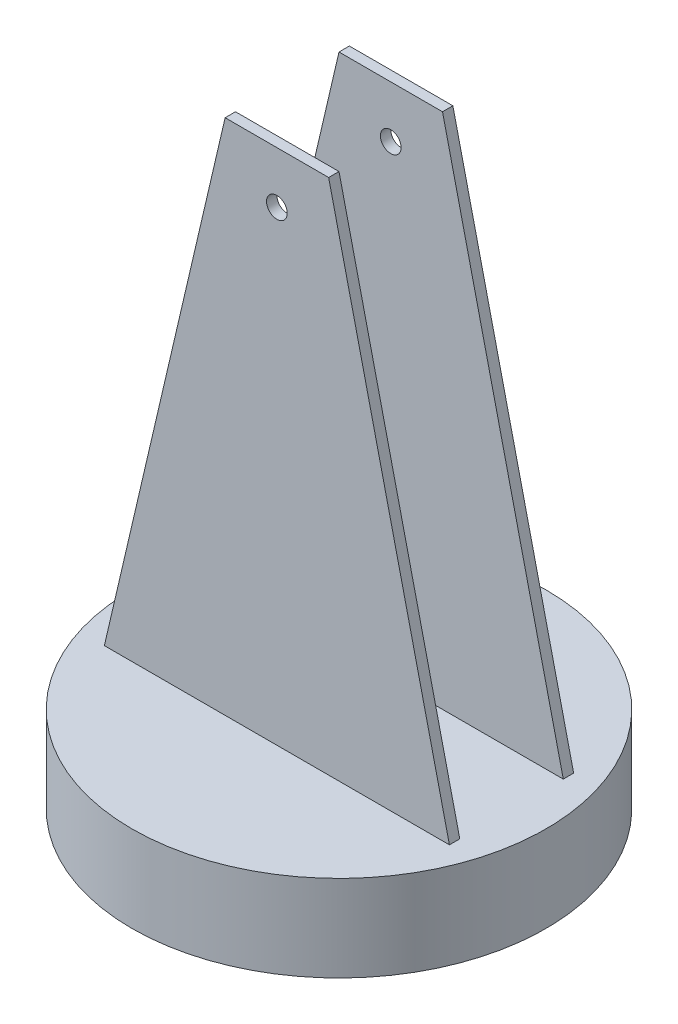
ISO-10303-21;
HEADER;
FILE_DESCRIPTION(('STEP AP214'),'2;1');
FILE_NAME('part.step','',(''),(''),'','','');
FILE_SCHEMA(('AUTOMOTIVE_DESIGN { 1 0 10303 214 1 1 1 1 }'));
ENDSEC;
DATA;
#1=APPLICATION_CONTEXT('core data for automotive mechanical design processes');
#2=APPLICATION_PROTOCOL_DEFINITION('international standard','automotive_design',2000,#1);
#3=PRODUCT_CONTEXT('',#1,'mechanical');
#4=PRODUCT('Part','Part','',(#3));
#5=PRODUCT_RELATED_PRODUCT_CATEGORY('part','',(#4));
#6=PRODUCT_DEFINITION_FORMATION('','',#4);
#7=PRODUCT_DEFINITION_CONTEXT('part definition',#1,'design');
#8=PRODUCT_DEFINITION('design','',#6,#7);
#9=PRODUCT_DEFINITION_SHAPE('','',#8);
#10=(LENGTH_UNIT() NAMED_UNIT(*) SI_UNIT(.MILLI.,.METRE.));
#11=(NAMED_UNIT(*) PLANE_ANGLE_UNIT() SI_UNIT($,.RADIAN.));
#12=(NAMED_UNIT(*) SI_UNIT($,.STERADIAN.) SOLID_ANGLE_UNIT());
#13=UNCERTAINTY_MEASURE_WITH_UNIT(LENGTH_MEASURE(1.E-05),#10,'distance_accuracy_value','');
#14=(GEOMETRIC_REPRESENTATION_CONTEXT(3) GLOBAL_UNCERTAINTY_ASSIGNED_CONTEXT((#13)) GLOBAL_UNIT_ASSIGNED_CONTEXT((#10,
#11,#12)) REPRESENTATION_CONTEXT('',''));
#15=CARTESIAN_POINT('',(0.,0.,0.));
#16=DIRECTION('',(0.,0.,1.));
#17=DIRECTION('',(1.,0.,0.));
#18=AXIS2_PLACEMENT_3D('',#15,#16,#17);
#19=CARTESIAN_POINT('',(50.,175.,-18.));
#20=DIRECTION('',(0.,0.,1.));
#21=DIRECTION('',(1.,0.,0.));
#22=AXIS2_PLACEMENT_3D('',#19,#20,#21);
#23=PLANE('',#22);
#24=CARTESIAN_POINT('',(0.,160.,-18.));
#25=DIRECTION('',(0.,0.,1.));
#26=DIRECTION('',(1.,0.,0.));
#27=AXIS2_PLACEMENT_3D('',#24,#25,#26);
#28=CIRCLE('',#27,3.);
#29=CARTESIAN_POINT('',(3.00000000000001,160.,-18.));
#30=VERTEX_POINT('',#29);
#31=EDGE_CURVE('E116',#30,#30,#28,.T.);
#32=ORIENTED_EDGE('',*,*,#31,.T.);
#33=EDGE_LOOP('',(#32));
#34=FACE_BOUND('',#33,.T.);
#35=DIRECTION('',(-0.227229615606418,0.973841209741793,0.));
#36=VECTOR('',#35,1.);
#37=CARTESIAN_POINT('',(16.8071654373024,167.255005268704,-18.));
#38=LINE('',#37,#36);
#39=CARTESIAN_POINT('',(50.,25.,-18.));
#40=VERTEX_POINT('',#39);
#41=CARTESIAN_POINT('',(15.,175.,-18.));
#42=VERTEX_POINT('',#41);
#43=EDGE_CURVE('E199',#40,#42,#38,.T.);
#44=ORIENTED_EDGE('',*,*,#43,.F.);
#45=DIRECTION('',(-1.,0.,0.));
#46=VECTOR('',#45,1.);
#47=CARTESIAN_POINT('',(50.,25.,-18.));
#48=LINE('',#47,#46);
#49=CARTESIAN_POINT('',(-50.,25.,-18.));
#50=VERTEX_POINT('',#49);
#51=EDGE_CURVE('E119',#40,#50,#48,.T.);
#52=ORIENTED_EDGE('',*,*,#51,.T.);
#53=DIRECTION('',(-0.227229615606418,-0.973841209741793,0.));
#54=VECTOR('',#53,1.);
#55=CARTESIAN_POINT('',(-11.6438356164384,189.383561643836,-18.));
#56=LINE('',#55,#54);
#57=CARTESIAN_POINT('',(-15.,175.,-18.));
#58=VERTEX_POINT('',#57);
#59=EDGE_CURVE('E131',#58,#50,#56,.T.);
#60=ORIENTED_EDGE('',*,*,#59,.F.);
#61=DIRECTION('',(-1.,0.,0.));
#62=VECTOR('',#61,1.);
#63=CARTESIAN_POINT('',(50.,175.,-18.));
#64=LINE('',#63,#62);
#65=EDGE_CURVE('E137',#42,#58,#64,.T.);
#66=ORIENTED_EDGE('',*,*,#65,.F.);
#67=EDGE_LOOP('',(#44,#52,#60,#66));
#68=FACE_BOUND('',#67,.T.);
#69=ADVANCED_FACE('F32',(#34,#68),#23,.F.);
#70=CARTESIAN_POINT('',(-50.,175.,-15.));
#71=DIRECTION('',(0.,0.,-1.));
#72=DIRECTION('',(-1.,0.,0.));
#73=AXIS2_PLACEMENT_3D('',#70,#71,#72);
#74=PLANE('',#73);
#75=CARTESIAN_POINT('',(0.,160.,-15.));
#76=DIRECTION('',(0.,0.,-1.));
#77=DIRECTION('',(-1.,0.,0.));
#78=AXIS2_PLACEMENT_3D('',#75,#76,#77);
#79=CIRCLE('',#78,3.);
#80=CARTESIAN_POINT('',(-3.,160.,-15.));
#81=VERTEX_POINT('',#80);
#82=EDGE_CURVE('E323',#81,#81,#79,.T.);
#83=ORIENTED_EDGE('',*,*,#82,.T.);
#84=EDGE_LOOP('',(#83));
#85=FACE_BOUND('',#84,.T.);
#86=DIRECTION('',(0.227229615606418,-0.973841209741793,0.));
#87=VECTOR('',#86,1.);
#88=CARTESIAN_POINT('',(11.6438356164384,189.383561643836,-15.));
#89=LINE('',#88,#87);
#90=CARTESIAN_POINT('',(15.,175.,-15.));
#91=VERTEX_POINT('',#90);
#92=CARTESIAN_POINT('',(50.,25.,-15.));
#93=VERTEX_POINT('',#92);
#94=EDGE_CURVE('E197',#91,#93,#89,.T.);
#95=ORIENTED_EDGE('',*,*,#94,.F.);
#96=DIRECTION('',(1.,0.,0.));
#97=VECTOR('',#96,1.);
#98=CARTESIAN_POINT('',(-50.,175.,-15.));
#99=LINE('',#98,#97);
#100=CARTESIAN_POINT('',(-15.,175.,-15.));
#101=VERTEX_POINT('',#100);
#102=EDGE_CURVE('E139',#101,#91,#99,.T.);
#103=ORIENTED_EDGE('',*,*,#102,.F.);
#104=DIRECTION('',(0.227229615606418,0.973841209741793,0.));
#105=VECTOR('',#104,1.);
#106=CARTESIAN_POINT('',(-16.8071654373024,167.255005268704,-15.));
#107=LINE('',#106,#105);
#108=CARTESIAN_POINT('',(-50.,25.,-15.));
#109=VERTEX_POINT('',#108);
#110=EDGE_CURVE('E47',#109,#101,#107,.T.);
#111=ORIENTED_EDGE('',*,*,#110,.F.);
#112=DIRECTION('',(1.,0.,0.));
#113=VECTOR('',#112,1.);
#114=CARTESIAN_POINT('',(-50.,25.,-15.));
#115=LINE('',#114,#113);
#116=EDGE_CURVE('E145',#109,#93,#115,.T.);
#117=ORIENTED_EDGE('',*,*,#116,.T.);
#118=EDGE_LOOP('',(#95,#103,#111,#117));
#119=FACE_BOUND('',#118,.T.);
#120=ADVANCED_FACE('F167',(#85,#119),#74,.F.);
#121=CARTESIAN_POINT('',(0.,175.,0.));
#122=DIRECTION('',(0.,1.,0.));
#123=DIRECTION('',(0.,0.,1.));
#124=AXIS2_PLACEMENT_3D('',#121,#122,#123);
#125=PLANE('',#124);
#126=ORIENTED_EDGE('',*,*,#102,.T.);
#127=DIRECTION('',(0.,0.,1.));
#128=VECTOR('',#127,1.);
#129=CARTESIAN_POINT('',(15.,175.,-132.));
#130=LINE('',#129,#128);
#131=EDGE_CURVE('E107',#42,#91,#130,.T.);
#132=ORIENTED_EDGE('',*,*,#131,.F.);
#133=ORIENTED_EDGE('',*,*,#65,.T.);
#134=DIRECTION('',(0.,0.,1.));
#135=VECTOR('',#134,1.);
#136=CARTESIAN_POINT('',(-15.,175.,-132.));
#137=LINE('',#136,#135);
#138=EDGE_CURVE('E204',#58,#101,#137,.T.);
#139=ORIENTED_EDGE('',*,*,#138,.T.);
#140=EDGE_LOOP('',(#126,#132,#133,#139));
#141=FACE_BOUND('',#140,.T.);
#142=ADVANCED_FACE('F173',(#141),#125,.T.);
#143=CARTESIAN_POINT('',(-50.,175.,15.));
#144=DIRECTION('',(0.,0.,1.));
#145=DIRECTION('',(1.,0.,0.));
#146=AXIS2_PLACEMENT_3D('',#143,#144,#145);
#147=PLANE('',#146);
#148=CARTESIAN_POINT('',(0.,160.,15.));
#149=DIRECTION('',(0.,0.,1.));
#150=DIRECTION('',(1.,0.,0.));
#151=AXIS2_PLACEMENT_3D('',#148,#149,#150);
#152=CIRCLE('',#151,3.);
#153=CARTESIAN_POINT('',(3.00000000000001,160.,15.));
#154=VERTEX_POINT('',#153);
#155=EDGE_CURVE('E326',#154,#154,#152,.T.);
#156=ORIENTED_EDGE('',*,*,#155,.T.);
#157=EDGE_LOOP('',(#156));
#158=FACE_BOUND('',#157,.T.);
#159=DIRECTION('',(-0.227229615606418,0.973841209741793,0.));
#160=VECTOR('',#159,1.);
#161=CARTESIAN_POINT('',(11.6438356164384,189.383561643836,15.));
#162=LINE('',#161,#160);
#163=CARTESIAN_POINT('',(50.,25.,15.));
#164=VERTEX_POINT('',#163);
#165=CARTESIAN_POINT('',(15.,175.,15.));
#166=VERTEX_POINT('',#165);
#167=EDGE_CURVE('E103',#164,#166,#162,.T.);
#168=ORIENTED_EDGE('',*,*,#167,.F.);
#169=DIRECTION('',(-1.,0.,0.));
#170=VECTOR('',#169,1.);
#171=CARTESIAN_POINT('',(-50.,25.,15.));
#172=LINE('',#171,#170);
#173=CARTESIAN_POINT('',(-50.,25.,15.));
#174=VERTEX_POINT('',#173);
#175=EDGE_CURVE('E130',#164,#174,#172,.T.);
#176=ORIENTED_EDGE('',*,*,#175,.T.);
#177=DIRECTION('',(-0.227229615606418,-0.973841209741793,0.));
#178=VECTOR('',#177,1.);
#179=CARTESIAN_POINT('',(-16.8071654373024,167.255005268704,15.));
#180=LINE('',#179,#178);
#181=CARTESIAN_POINT('',(-15.,175.,15.));
#182=VERTEX_POINT('',#181);
#183=EDGE_CURVE('E196',#182,#174,#180,.T.);
#184=ORIENTED_EDGE('',*,*,#183,.F.);
#185=DIRECTION('',(-1.,0.,0.));
#186=VECTOR('',#185,1.);
#187=CARTESIAN_POINT('',(0.,175.,15.));
#188=LINE('',#187,#186);
#189=EDGE_CURVE('E120',#166,#182,#188,.T.);
#190=ORIENTED_EDGE('',*,*,#189,.F.);
#191=EDGE_LOOP('',(#168,#176,#184,#190));
#192=FACE_BOUND('',#191,.T.);
#193=ADVANCED_FACE('F195',(#158,#192),#147,.F.);
#194=CARTESIAN_POINT('',(50.,175.,18.));
#195=DIRECTION('',(0.,0.,-1.));
#196=DIRECTION('',(-1.,0.,0.));
#197=AXIS2_PLACEMENT_3D('',#194,#195,#196);
#198=PLANE('',#197);
#199=CARTESIAN_POINT('',(0.,160.,18.));
#200=DIRECTION('',(0.,0.,1.));
#201=DIRECTION('',(1.,0.,0.));
#202=AXIS2_PLACEMENT_3D('',#199,#200,#201);
#203=CIRCLE('',#202,3.);
#204=CARTESIAN_POINT('',(3.00000000000001,160.,18.));
#205=VERTEX_POINT('',#204);
#206=EDGE_CURVE('E331',#205,#205,#203,.T.);
#207=ORIENTED_EDGE('',*,*,#206,.F.);
#208=EDGE_LOOP('',(#207));
#209=FACE_BOUND('',#208,.T.);
#210=DIRECTION('',(-0.227229615606418,0.973841209741793,0.));
#211=VECTOR('',#210,1.);
#212=CARTESIAN_POINT('',(52.9504741833509,12.3551106427819,18.));
#213=LINE('',#212,#211);
#214=CARTESIAN_POINT('',(50.,25.,18.));
#215=VERTEX_POINT('',#214);
#216=CARTESIAN_POINT('',(15.,175.,18.));
#217=VERTEX_POINT('',#216);
#218=EDGE_CURVE('E100',#215,#217,#213,.T.);
#219=ORIENTED_EDGE('',*,*,#218,.T.);
#220=DIRECTION('',(1.,0.,0.));
#221=VECTOR('',#220,1.);
#222=CARTESIAN_POINT('',(50.,175.,18.));
#223=LINE('',#222,#221);
#224=CARTESIAN_POINT('',(-15.,175.,18.));
#225=VERTEX_POINT('',#224);
#226=EDGE_CURVE('E112',#225,#217,#223,.T.);
#227=ORIENTED_EDGE('',*,*,#226,.F.);
#228=DIRECTION('',(-0.227229615606418,-0.973841209741793,0.));
#229=VECTOR('',#228,1.);
#230=CARTESIAN_POINT('',(-52.9504741833509,12.3551106427819,18.));
#231=LINE('',#230,#229);
#232=CARTESIAN_POINT('',(-50.,25.,18.));
#233=VERTEX_POINT('',#232);
#234=EDGE_CURVE('E54',#225,#233,#231,.T.);
#235=ORIENTED_EDGE('',*,*,#234,.T.);
#236=DIRECTION('',(1.,0.,0.));
#237=VECTOR('',#236,1.);
#238=CARTESIAN_POINT('',(50.,25.,18.));
#239=LINE('',#238,#237);
#240=EDGE_CURVE('E114',#233,#215,#239,.T.);
#241=ORIENTED_EDGE('',*,*,#240,.T.);
#242=EDGE_LOOP('',(#219,#227,#235,#241));
#243=FACE_BOUND('',#242,.T.);
#244=ADVANCED_FACE('F111',(#209,#243),#198,.F.);
#245=CARTESIAN_POINT('',(0.,175.,0.));
#246=DIRECTION('',(0.,-1.,0.));
#247=DIRECTION('',(0.,0.,-1.));
#248=AXIS2_PLACEMENT_3D('',#245,#246,#247);
#249=PLANE('',#248);
#250=EDGE_CURVE('E97',#166,#217,#130,.T.);
#251=ORIENTED_EDGE('',*,*,#250,.F.);
#252=ORIENTED_EDGE('',*,*,#189,.T.);
#253=DIRECTION('',(0.,0.,-1.));
#254=VECTOR('',#253,1.);
#255=CARTESIAN_POINT('',(-15.,175.,0.));
#256=LINE('',#255,#254);
#257=EDGE_CURVE('E11',#225,#182,#256,.T.);
#258=ORIENTED_EDGE('',*,*,#257,.F.);
#259=ORIENTED_EDGE('',*,*,#226,.T.);
#260=EDGE_LOOP('',(#251,#252,#258,#259));
#261=FACE_BOUND('',#260,.T.);
#262=ADVANCED_FACE('F118',(#261),#249,.F.);
#263=CARTESIAN_POINT('',(0.,25.,0.));
#264=DIRECTION('',(0.,1.,0.));
#265=DIRECTION('',(0.,0.,1.));
#266=AXIS2_PLACEMENT_3D('',#263,#264,#265);
#267=PLANE('',#266);
#268=ORIENTED_EDGE('',*,*,#51,.F.);
#269=DIRECTION('',(0.,0.,-1.));
#270=VECTOR('',#269,1.);
#271=CARTESIAN_POINT('',(50.,25.,-15.));
#272=LINE('',#271,#270);
#273=EDGE_CURVE('E140',#93,#40,#272,.T.);
#274=ORIENTED_EDGE('',*,*,#273,.F.);
#275=ORIENTED_EDGE('',*,*,#116,.F.);
#276=DIRECTION('',(0.,0.,1.));
#277=VECTOR('',#276,1.);
#278=CARTESIAN_POINT('',(-50.,25.,-18.));
#279=LINE('',#278,#277);
#280=EDGE_CURVE('E123',#50,#109,#279,.T.);
#281=ORIENTED_EDGE('',*,*,#280,.F.);
#282=EDGE_LOOP('',(#268,#274,#275,#281));
#283=FACE_BOUND('',#282,.T.);
#284=ORIENTED_EDGE('',*,*,#175,.F.);
#285=DIRECTION('',(0.,0.,-1.));
#286=VECTOR('',#285,1.);
#287=CARTESIAN_POINT('',(50.,25.,15.));
#288=LINE('',#287,#286);
#289=EDGE_CURVE('E128',#215,#164,#288,.T.);
#290=ORIENTED_EDGE('',*,*,#289,.F.);
#291=ORIENTED_EDGE('',*,*,#240,.F.);
#292=DIRECTION('',(0.,0.,1.));
#293=VECTOR('',#292,1.);
#294=CARTESIAN_POINT('',(-50.,25.,18.));
#295=LINE('',#294,#293);
#296=EDGE_CURVE('E134',#174,#233,#295,.T.);
#297=ORIENTED_EDGE('',*,*,#296,.F.);
#298=EDGE_LOOP('',(#284,#290,#291,#297));
#299=FACE_BOUND('',#298,.T.);
#300=CARTESIAN_POINT('',(0.,25.,0.));
#301=DIRECTION('',(0.,1.,0.));
#302=DIRECTION('',(0.,0.,1.));
#303=AXIS2_PLACEMENT_3D('',#300,#301,#302);
#304=CIRCLE('',#303,60.);
#305=CARTESIAN_POINT('',(0.,25.,60.));
#306=VERTEX_POINT('',#305);
#307=EDGE_CURVE('E40',#306,#306,#304,.T.);
#308=ORIENTED_EDGE('',*,*,#307,.T.);
#309=EDGE_LOOP('',(#308));
#310=FACE_BOUND('',#309,.T.);
#311=ADVANCED_FACE('F163',(#283,#299,#310),#267,.T.);
#312=CARTESIAN_POINT('',(0.,25.,0.));
#313=DIRECTION('',(0.,-1.,0.));
#314=DIRECTION('',(0.,0.,-1.));
#315=AXIS2_PLACEMENT_3D('',#312,#313,#314);
#316=CYLINDRICAL_SURFACE('',#315,60.);
#317=ORIENTED_EDGE('',*,*,#307,.F.);
#318=EDGE_LOOP('',(#317));
#319=FACE_BOUND('',#318,.T.);
#320=CARTESIAN_POINT('',(0.,0.,0.));
#321=DIRECTION('',(0.,1.,0.));
#322=DIRECTION('',(0.,0.,1.));
#323=AXIS2_PLACEMENT_3D('',#320,#321,#322);
#324=CIRCLE('',#323,60.);
#325=CARTESIAN_POINT('',(0.,0.,60.));
#326=VERTEX_POINT('',#325);
#327=EDGE_CURVE('E142',#326,#326,#324,.T.);
#328=ORIENTED_EDGE('',*,*,#327,.T.);
#329=EDGE_LOOP('',(#328));
#330=FACE_BOUND('',#329,.T.);
#331=ADVANCED_FACE('F34',(#319,#330),#316,.T.);
#332=CARTESIAN_POINT('',(0.,0.,0.));
#333=DIRECTION('',(0.,1.,0.));
#334=DIRECTION('',(0.,0.,1.));
#335=AXIS2_PLACEMENT_3D('',#332,#333,#334);
#336=PLANE('',#335);
#337=ORIENTED_EDGE('',*,*,#327,.F.);
#338=EDGE_LOOP('',(#337));
#339=FACE_BOUND('',#338,.T.);
#340=ADVANCED_FACE('F154',(#339),#336,.F.);
#341=CARTESIAN_POINT('',(-52.9504741833509,12.3551106427819,-132.));
#342=DIRECTION('',(-0.973841209741793,0.227229615606418,0.));
#343=DIRECTION('',(-0.227229615606418,-0.973841209741793,0.));
#344=AXIS2_PLACEMENT_3D('',#341,#342,#343);
#345=PLANE('',#344);
#346=ORIENTED_EDGE('',*,*,#183,.T.);
#347=ORIENTED_EDGE('',*,*,#296,.T.);
#348=ORIENTED_EDGE('',*,*,#234,.F.);
#349=ORIENTED_EDGE('',*,*,#257,.T.);
#350=EDGE_LOOP('',(#346,#347,#348,#349));
#351=FACE_BOUND('',#350,.T.);
#352=ADVANCED_FACE('F156',(#351),#345,.T.);
#353=ORIENTED_EDGE('',*,*,#59,.T.);
#354=ORIENTED_EDGE('',*,*,#280,.T.);
#355=ORIENTED_EDGE('',*,*,#110,.T.);
#356=ORIENTED_EDGE('',*,*,#138,.F.);
#357=EDGE_LOOP('',(#353,#354,#355,#356));
#358=FACE_BOUND('',#357,.T.);
#359=ADVANCED_FACE('F161',(#358),#345,.T.);
#360=CARTESIAN_POINT('',(52.9504741833509,12.3551106427819,-132.));
#361=DIRECTION('',(0.973841209741793,0.227229615606418,0.));
#362=DIRECTION('',(-0.227229615606418,0.973841209741793,0.));
#363=AXIS2_PLACEMENT_3D('',#360,#361,#362);
#364=PLANE('',#363);
#365=ORIENTED_EDGE('',*,*,#167,.T.);
#366=ORIENTED_EDGE('',*,*,#250,.T.);
#367=ORIENTED_EDGE('',*,*,#218,.F.);
#368=ORIENTED_EDGE('',*,*,#289,.T.);
#369=EDGE_LOOP('',(#365,#366,#367,#368));
#370=FACE_BOUND('',#369,.T.);
#371=ADVANCED_FACE('F99',(#370),#364,.T.);
#372=ORIENTED_EDGE('',*,*,#43,.T.);
#373=ORIENTED_EDGE('',*,*,#131,.T.);
#374=ORIENTED_EDGE('',*,*,#94,.T.);
#375=ORIENTED_EDGE('',*,*,#273,.T.);
#376=EDGE_LOOP('',(#372,#373,#374,#375));
#377=FACE_BOUND('',#376,.T.);
#378=ADVANCED_FACE('F217',(#377),#364,.T.);
#379=CARTESIAN_POINT('',(0.,160.,-132.));
#380=DIRECTION('',(0.,0.,1.));
#381=DIRECTION('',(1.,0.,0.));
#382=AXIS2_PLACEMENT_3D('',#379,#380,#381);
#383=CYLINDRICAL_SURFACE('',#382,3.);
#384=ORIENTED_EDGE('',*,*,#206,.T.);
#385=EDGE_LOOP('',(#384));
#386=FACE_BOUND('',#385,.T.);
#387=ORIENTED_EDGE('',*,*,#155,.F.);
#388=EDGE_LOOP('',(#387));
#389=FACE_BOUND('',#388,.T.);
#390=ADVANCED_FACE('F219',(#386,#389),#383,.F.);
#391=ORIENTED_EDGE('',*,*,#82,.F.);
#392=EDGE_LOOP('',(#391));
#393=FACE_BOUND('',#392,.T.);
#394=ORIENTED_EDGE('',*,*,#31,.F.);
#395=EDGE_LOOP('',(#394));
#396=FACE_BOUND('',#395,.T.);
#397=ADVANCED_FACE('F225',(#393,#396),#383,.F.);
#398=CLOSED_SHELL('',(#69,#120,#142,#193,#244,#262,#311,#331,#340,#352,#359,#371,#378,#390,#397));
#399=MANIFOLD_SOLID_BREP('B2',#398);
#400=ADVANCED_BREP_SHAPE_REPRESENTATION('',(#18,#399),#14);
#401=SHAPE_DEFINITION_REPRESENTATION(#9,#400);
ENDSEC;
END-ISO-10303-21;
